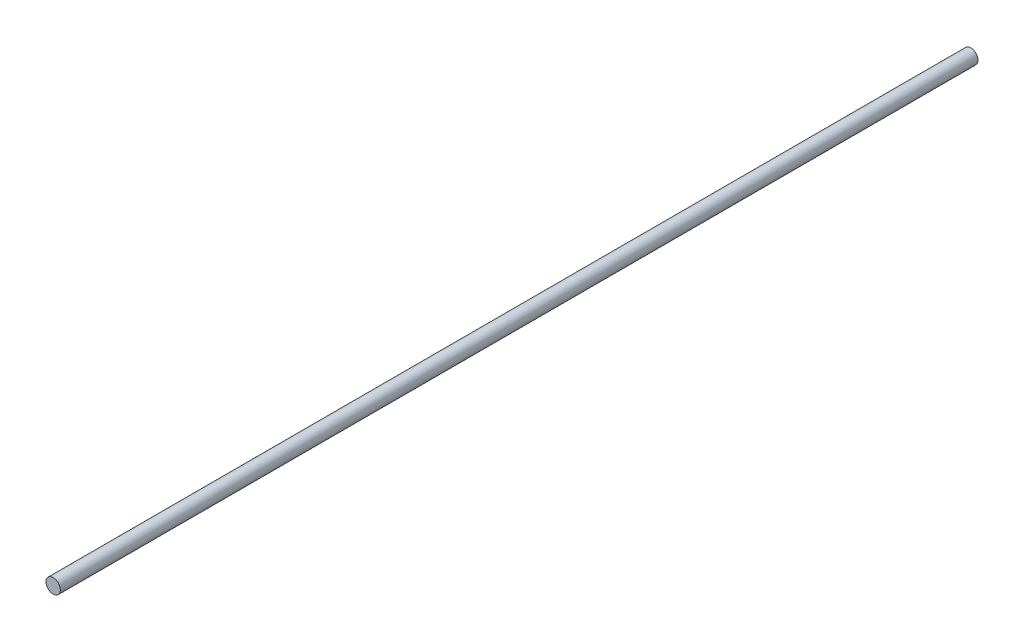
ISO-10303-21;
HEADER;
FILE_DESCRIPTION(('STEP AP214'),'2;1');
FILE_NAME('part.step','',(''),(''),'','','');
FILE_SCHEMA(('AUTOMOTIVE_DESIGN { 1 0 10303 214 1 1 1 1 }'));
ENDSEC;
DATA;
#1=APPLICATION_CONTEXT('core data for automotive mechanical design processes');
#2=APPLICATION_PROTOCOL_DEFINITION('international standard','automotive_design',2000,#1);
#3=PRODUCT_CONTEXT('',#1,'mechanical');
#4=PRODUCT('Part','Part','',(#3));
#5=PRODUCT_RELATED_PRODUCT_CATEGORY('part','',(#4));
#6=PRODUCT_DEFINITION_FORMATION('','',#4);
#7=PRODUCT_DEFINITION_CONTEXT('part definition',#1,'design');
#8=PRODUCT_DEFINITION('design','',#6,#7);
#9=PRODUCT_DEFINITION_SHAPE('','',#8);
#10=(LENGTH_UNIT() NAMED_UNIT(*) SI_UNIT(.MILLI.,.METRE.));
#11=(NAMED_UNIT(*) PLANE_ANGLE_UNIT() SI_UNIT($,.RADIAN.));
#12=(NAMED_UNIT(*) SI_UNIT($,.STERADIAN.) SOLID_ANGLE_UNIT());
#13=UNCERTAINTY_MEASURE_WITH_UNIT(LENGTH_MEASURE(1.E-05),#10,'distance_accuracy_value','');
#14=(GEOMETRIC_REPRESENTATION_CONTEXT(3) GLOBAL_UNCERTAINTY_ASSIGNED_CONTEXT((#13)) GLOBAL_UNIT_ASSIGNED_CONTEXT((#10,
#11,#12)) REPRESENTATION_CONTEXT('',''));
#15=CARTESIAN_POINT('',(0.,0.,0.));
#16=DIRECTION('',(0.,0.,1.));
#17=DIRECTION('',(1.,0.,0.));
#18=AXIS2_PLACEMENT_3D('',#15,#16,#17);
#19=CARTESIAN_POINT('',(0.,0.,406.4));
#20=DIRECTION('',(0.,0.,-1.));
#21=DIRECTION('',(-1.,0.,0.));
#22=AXIS2_PLACEMENT_3D('',#19,#20,#21);
#23=CYLINDRICAL_SURFACE('',#22,6.35);
#24=CARTESIAN_POINT('',(0.,0.,406.4));
#25=DIRECTION('',(0.,0.,1.));
#26=DIRECTION('',(1.,0.,0.));
#27=AXIS2_PLACEMENT_3D('',#24,#25,#26);
#28=CIRCLE('',#27,6.35);
#29=CARTESIAN_POINT('',(6.35,0.,406.4));
#30=VERTEX_POINT('',#29);
#31=EDGE_CURVE('E10',#30,#30,#28,.T.);
#32=ORIENTED_EDGE('',*,*,#31,.F.);
#33=EDGE_LOOP('',(#32));
#34=FACE_BOUND('',#33,.T.);
#35=CARTESIAN_POINT('',(0.,0.,-406.4));
#36=DIRECTION('',(0.,0.,1.));
#37=DIRECTION('',(1.,0.,0.));
#38=AXIS2_PLACEMENT_3D('',#35,#36,#37);
#39=CIRCLE('',#38,6.35);
#40=CARTESIAN_POINT('',(6.35,0.,-406.4));
#41=VERTEX_POINT('',#40);
#42=EDGE_CURVE('E37',#41,#41,#39,.T.);
#43=ORIENTED_EDGE('',*,*,#42,.T.);
#44=EDGE_LOOP('',(#43));
#45=FACE_BOUND('',#44,.T.);
#46=ADVANCED_FACE('F34',(#34,#45),#23,.T.);
#47=CARTESIAN_POINT('',(0.,0.,406.4));
#48=DIRECTION('',(0.,0.,1.));
#49=DIRECTION('',(1.,0.,0.));
#50=AXIS2_PLACEMENT_3D('',#47,#48,#49);
#51=PLANE('',#50);
#52=ORIENTED_EDGE('',*,*,#31,.T.);
#53=EDGE_LOOP('',(#52));
#54=FACE_BOUND('',#53,.T.);
#55=ADVANCED_FACE('F49',(#54),#51,.T.);
#56=CARTESIAN_POINT('',(0.,0.,-406.4));
#57=DIRECTION('',(0.,0.,1.));
#58=DIRECTION('',(1.,0.,0.));
#59=AXIS2_PLACEMENT_3D('',#56,#57,#58);
#60=PLANE('',#59);
#61=ORIENTED_EDGE('',*,*,#42,.F.);
#62=EDGE_LOOP('',(#61));
#63=FACE_BOUND('',#62,.T.);
#64=ADVANCED_FACE('F47',(#63),#60,.F.);
#65=CLOSED_SHELL('',(#46,#55,#64));
#66=MANIFOLD_SOLID_BREP('B2',#65);
#67=ADVANCED_BREP_SHAPE_REPRESENTATION('',(#18,#66),#14);
#68=SHAPE_DEFINITION_REPRESENTATION(#9,#67);
ENDSEC;
END-ISO-10303-21;
